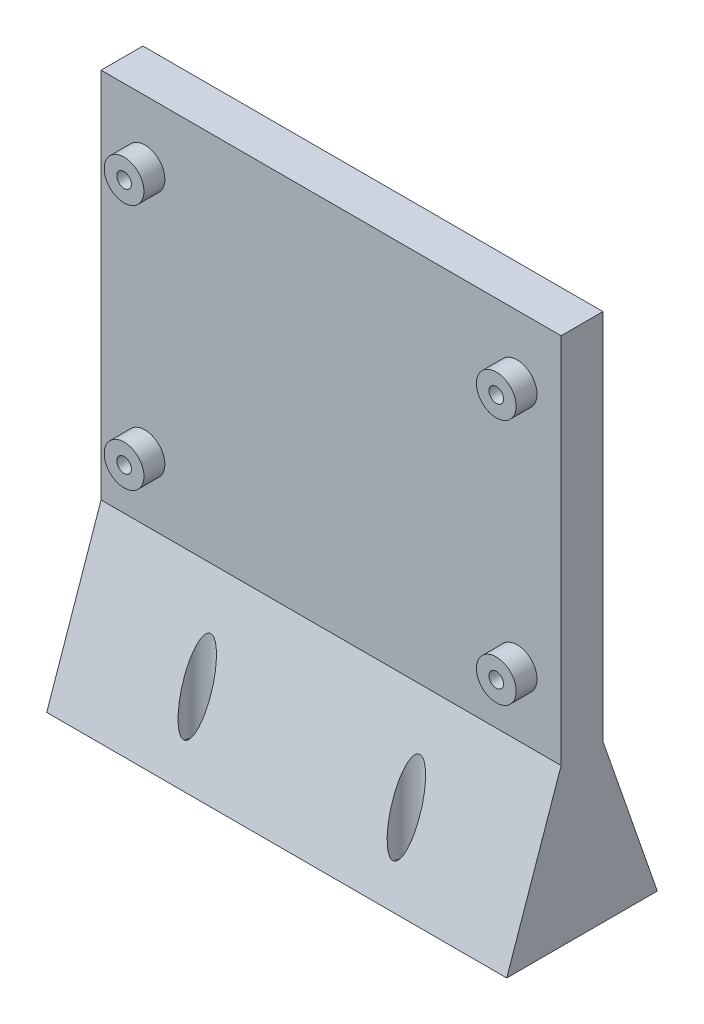
ISO-10303-21;
HEADER;
FILE_DESCRIPTION(('STEP AP214'),'2;1');
FILE_NAME('part.step','',(''),(''),'','','');
FILE_SCHEMA(('AUTOMOTIVE_DESIGN { 1 0 10303 214 1 1 1 1 }'));
ENDSEC;
DATA;
#1=APPLICATION_CONTEXT('core data for automotive mechanical design processes');
#2=APPLICATION_PROTOCOL_DEFINITION('international standard','automotive_design',2000,#1);
#3=PRODUCT_CONTEXT('',#1,'mechanical');
#4=PRODUCT('Part','Part','',(#3));
#5=PRODUCT_RELATED_PRODUCT_CATEGORY('part','',(#4));
#6=PRODUCT_DEFINITION_FORMATION('','',#4);
#7=PRODUCT_DEFINITION_CONTEXT('part definition',#1,'design');
#8=PRODUCT_DEFINITION('design','',#6,#7);
#9=PRODUCT_DEFINITION_SHAPE('','',#8);
#10=(LENGTH_UNIT() NAMED_UNIT(*) SI_UNIT(.MILLI.,.METRE.));
#11=(NAMED_UNIT(*) PLANE_ANGLE_UNIT() SI_UNIT($,.RADIAN.));
#12=(NAMED_UNIT(*) SI_UNIT($,.STERADIAN.) SOLID_ANGLE_UNIT());
#13=UNCERTAINTY_MEASURE_WITH_UNIT(LENGTH_MEASURE(1.E-05),#10,'distance_accuracy_value','');
#14=(GEOMETRIC_REPRESENTATION_CONTEXT(3) GLOBAL_UNCERTAINTY_ASSIGNED_CONTEXT((#13)) GLOBAL_UNIT_ASSIGNED_CONTEXT((#10,
#11,#12)) REPRESENTATION_CONTEXT('',''));
#15=CARTESIAN_POINT('',(0.,0.,0.));
#16=DIRECTION('',(0.,0.,1.));
#17=DIRECTION('',(1.,0.,0.));
#18=AXIS2_PLACEMENT_3D('',#15,#16,#17);
#19=CARTESIAN_POINT('',(55.,0.,10.));
#20=DIRECTION('',(1.,0.,0.));
#21=DIRECTION('',(0.,1.,0.));
#22=AXIS2_PLACEMENT_3D('',#19,#20,#21);
#23=PLANE('',#22);
#24=DIRECTION('',(0.,-1.,0.));
#25=VECTOR('',#24,1.);
#26=CARTESIAN_POINT('',(55.,0.,0.));
#27=LINE('',#26,#25);
#28=CARTESIAN_POINT('',(55.,44.5,0.));
#29=VERTEX_POINT('',#28);
#30=CARTESIAN_POINT('',(55.,-44.5,0.));
#31=VERTEX_POINT('',#30);
#32=EDGE_CURVE('E268',#29,#31,#27,.T.);
#33=ORIENTED_EDGE('',*,*,#32,.F.);
#34=DIRECTION('',(0.,0.,-1.));
#35=VECTOR('',#34,1.);
#36=CARTESIAN_POINT('',(55.,44.5,10.));
#37=LINE('',#36,#35);
#38=CARTESIAN_POINT('',(55.,44.5,10.));
#39=VERTEX_POINT('',#38);
#40=EDGE_CURVE('E13',#39,#29,#37,.T.);
#41=ORIENTED_EDGE('',*,*,#40,.F.);
#42=DIRECTION('',(0.,-1.,0.));
#43=VECTOR('',#42,1.);
#44=CARTESIAN_POINT('',(55.,0.,10.));
#45=LINE('',#44,#43);
#46=CARTESIAN_POINT('',(55.,-44.5,10.));
#47=VERTEX_POINT('',#46);
#48=EDGE_CURVE('E286',#39,#47,#45,.T.);
#49=ORIENTED_EDGE('',*,*,#48,.T.);
#50=DIRECTION('',(0.,-0.944836198498626,0.327543215479524));
#51=VECTOR('',#50,1.);
#52=CARTESIAN_POINT('',(55.,-44.5,10.));
#53=LINE('',#52,#51);
#54=CARTESIAN_POINT('',(55.,-82.,23.));
#55=VERTEX_POINT('',#54);
#56=EDGE_CURVE('E140',#47,#55,#53,.T.);
#57=ORIENTED_EDGE('',*,*,#56,.T.);
#58=DIRECTION('',(0.,0.,-1.));
#59=VECTOR('',#58,1.);
#60=CARTESIAN_POINT('',(55.,-82.,23.));
#61=LINE('',#60,#59);
#62=CARTESIAN_POINT('',(55.,-82.,-13.));
#63=VERTEX_POINT('',#62);
#64=EDGE_CURVE('E132',#55,#63,#61,.T.);
#65=ORIENTED_EDGE('',*,*,#64,.T.);
#66=DIRECTION('',(0.,-0.944836198498626,-0.327543215479523));
#67=VECTOR('',#66,1.);
#68=CARTESIAN_POINT('',(55.,-44.5,0.));
#69=LINE('',#68,#67);
#70=EDGE_CURVE('E131',#31,#63,#69,.T.);
#71=ORIENTED_EDGE('',*,*,#70,.F.);
#72=EDGE_LOOP('',(#33,#41,#49,#57,#65,#71));
#73=FACE_BOUND('',#72,.T.);
#74=ADVANCED_FACE('F51',(#73),#23,.T.);
#75=CARTESIAN_POINT('',(0.,44.5,10.));
#76=DIRECTION('',(0.,1.,0.));
#77=DIRECTION('',(0.,0.,1.));
#78=AXIS2_PLACEMENT_3D('',#75,#76,#77);
#79=PLANE('',#78);
#80=DIRECTION('',(1.,0.,0.));
#81=VECTOR('',#80,1.);
#82=CARTESIAN_POINT('',(0.,44.5,0.));
#83=LINE('',#82,#81);
#84=CARTESIAN_POINT('',(-55.,44.5,0.));
#85=VERTEX_POINT('',#84);
#86=EDGE_CURVE('E271',#85,#29,#83,.T.);
#87=ORIENTED_EDGE('',*,*,#86,.F.);
#88=DIRECTION('',(0.,0.,-1.));
#89=VECTOR('',#88,1.);
#90=CARTESIAN_POINT('',(-55.,44.5,10.));
#91=LINE('',#90,#89);
#92=CARTESIAN_POINT('',(-55.,44.5,10.));
#93=VERTEX_POINT('',#92);
#94=EDGE_CURVE('E60',#93,#85,#91,.T.);
#95=ORIENTED_EDGE('',*,*,#94,.F.);
#96=DIRECTION('',(1.,0.,0.));
#97=VECTOR('',#96,1.);
#98=CARTESIAN_POINT('',(0.,44.5,10.));
#99=LINE('',#98,#97);
#100=EDGE_CURVE('E282',#93,#39,#99,.T.);
#101=ORIENTED_EDGE('',*,*,#100,.T.);
#102=ORIENTED_EDGE('',*,*,#40,.T.);
#103=EDGE_LOOP('',(#87,#95,#101,#102));
#104=FACE_BOUND('',#103,.T.);
#105=ADVANCED_FACE('F260',(#104),#79,.T.);
#106=CARTESIAN_POINT('',(-55.,0.,10.));
#107=DIRECTION('',(1.,0.,0.));
#108=DIRECTION('',(0.,1.,0.));
#109=AXIS2_PLACEMENT_3D('',#106,#107,#108);
#110=PLANE('',#109);
#111=DIRECTION('',(0.,-1.,0.));
#112=VECTOR('',#111,1.);
#113=CARTESIAN_POINT('',(-55.,0.,0.));
#114=LINE('',#113,#112);
#115=CARTESIAN_POINT('',(-55.,-44.5,0.));
#116=VERTEX_POINT('',#115);
#117=EDGE_CURVE('E138',#85,#116,#114,.T.);
#118=ORIENTED_EDGE('',*,*,#117,.T.);
#119=DIRECTION('',(0.,-0.944836198498626,-0.327543215479523));
#120=VECTOR('',#119,1.);
#121=CARTESIAN_POINT('',(-55.,-44.5,0.));
#122=LINE('',#121,#120);
#123=CARTESIAN_POINT('',(-55.,-82.,-13.));
#124=VERTEX_POINT('',#123);
#125=EDGE_CURVE('E129',#116,#124,#122,.T.);
#126=ORIENTED_EDGE('',*,*,#125,.T.);
#127=DIRECTION('',(0.,0.,1.));
#128=VECTOR('',#127,1.);
#129=CARTESIAN_POINT('',(-55.,-82.,23.));
#130=LINE('',#129,#128);
#131=CARTESIAN_POINT('',(-55.,-82.,23.));
#132=VERTEX_POINT('',#131);
#133=EDGE_CURVE('E104',#124,#132,#130,.T.);
#134=ORIENTED_EDGE('',*,*,#133,.T.);
#135=DIRECTION('',(0.,-0.944836198498626,0.327543215479524));
#136=VECTOR('',#135,1.);
#137=CARTESIAN_POINT('',(-55.,-44.5,10.));
#138=LINE('',#137,#136);
#139=CARTESIAN_POINT('',(-55.,-44.5,10.));
#140=VERTEX_POINT('',#139);
#141=EDGE_CURVE('E142',#140,#132,#138,.T.);
#142=ORIENTED_EDGE('',*,*,#141,.F.);
#143=DIRECTION('',(0.,-1.,0.));
#144=VECTOR('',#143,1.);
#145=CARTESIAN_POINT('',(-55.,0.,10.));
#146=LINE('',#145,#144);
#147=EDGE_CURVE('E73',#93,#140,#146,.T.);
#148=ORIENTED_EDGE('',*,*,#147,.F.);
#149=ORIENTED_EDGE('',*,*,#94,.T.);
#150=EDGE_LOOP('',(#118,#126,#134,#142,#148,#149));
#151=FACE_BOUND('',#150,.T.);
#152=ADVANCED_FACE('F136',(#151),#110,.F.);
#153=CARTESIAN_POINT('',(0.,0.,10.));
#154=DIRECTION('',(0.,0.,1.));
#155=DIRECTION('',(1.,0.,0.));
#156=AXIS2_PLACEMENT_3D('',#153,#154,#155);
#157=PLANE('',#156);
#158=CARTESIAN_POINT('',(44.5,29.5,10.));
#159=DIRECTION('',(0.,0.,1.));
#160=DIRECTION('',(1.,0.,0.));
#161=AXIS2_PLACEMENT_3D('',#158,#159,#160);
#162=CIRCLE('',#161,4.75);
#163=CARTESIAN_POINT('',(49.25,29.5,10.));
#164=VERTEX_POINT('',#163);
#165=EDGE_CURVE('E353',#164,#164,#162,.T.);
#166=ORIENTED_EDGE('',*,*,#165,.F.);
#167=EDGE_LOOP('',(#166));
#168=FACE_BOUND('',#167,.T.);
#169=CARTESIAN_POINT('',(44.5,-29.5,10.));
#170=DIRECTION('',(0.,0.,1.));
#171=DIRECTION('',(1.,0.,0.));
#172=AXIS2_PLACEMENT_3D('',#169,#170,#171);
#173=CIRCLE('',#172,4.75);
#174=CARTESIAN_POINT('',(49.25,-29.5,10.));
#175=VERTEX_POINT('',#174);
#176=EDGE_CURVE('E392',#175,#175,#173,.T.);
#177=ORIENTED_EDGE('',*,*,#176,.F.);
#178=EDGE_LOOP('',(#177));
#179=FACE_BOUND('',#178,.T.);
#180=CARTESIAN_POINT('',(-44.5,-29.5,10.));
#181=DIRECTION('',(0.,0.,1.));
#182=DIRECTION('',(1.,0.,0.));
#183=AXIS2_PLACEMENT_3D('',#180,#181,#182);
#184=CIRCLE('',#183,4.75);
#185=CARTESIAN_POINT('',(-39.75,-29.5,10.));
#186=VERTEX_POINT('',#185);
#187=EDGE_CURVE('E395',#186,#186,#184,.T.);
#188=ORIENTED_EDGE('',*,*,#187,.F.);
#189=EDGE_LOOP('',(#188));
#190=FACE_BOUND('',#189,.T.);
#191=CARTESIAN_POINT('',(-44.5,29.5,10.));
#192=DIRECTION('',(0.,0.,1.));
#193=DIRECTION('',(1.,0.,0.));
#194=AXIS2_PLACEMENT_3D('',#191,#192,#193);
#195=CIRCLE('',#194,4.75);
#196=CARTESIAN_POINT('',(-39.75,29.5,10.));
#197=VERTEX_POINT('',#196);
#198=EDGE_CURVE('E287',#197,#197,#195,.T.);
#199=ORIENTED_EDGE('',*,*,#198,.F.);
#200=EDGE_LOOP('',(#199));
#201=FACE_BOUND('',#200,.T.);
#202=ORIENTED_EDGE('',*,*,#48,.F.);
#203=ORIENTED_EDGE('',*,*,#100,.F.);
#204=ORIENTED_EDGE('',*,*,#147,.T.);
#205=DIRECTION('',(1.,0.,0.));
#206=VECTOR('',#205,1.);
#207=CARTESIAN_POINT('',(0.,-44.5,10.));
#208=LINE('',#207,#206);
#209=EDGE_CURVE('E68',#140,#47,#208,.T.);
#210=ORIENTED_EDGE('',*,*,#209,.T.);
#211=EDGE_LOOP('',(#202,#203,#204,#210));
#212=FACE_BOUND('',#211,.T.);
#213=ADVANCED_FACE('F300',(#168,#179,#190,#201,#212),#157,.T.);
#214=CARTESIAN_POINT('',(0.,0.,0.));
#215=DIRECTION('',(0.,0.,1.));
#216=DIRECTION('',(1.,0.,0.));
#217=AXIS2_PLACEMENT_3D('',#214,#215,#216);
#218=PLANE('',#217);
#219=ORIENTED_EDGE('',*,*,#32,.T.);
#220=DIRECTION('',(1.,0.,0.));
#221=VECTOR('',#220,1.);
#222=CARTESIAN_POINT('',(0.,-44.5,0.));
#223=LINE('',#222,#221);
#224=EDGE_CURVE('E278',#116,#31,#223,.T.);
#225=ORIENTED_EDGE('',*,*,#224,.F.);
#226=ORIENTED_EDGE('',*,*,#117,.F.);
#227=ORIENTED_EDGE('',*,*,#86,.T.);
#228=EDGE_LOOP('',(#219,#225,#226,#227));
#229=FACE_BOUND('',#228,.T.);
#230=CARTESIAN_POINT('',(-44.5,29.5,0.));
#231=DIRECTION('',(0.,0.,1.));
#232=DIRECTION('',(1.,0.,0.));
#233=AXIS2_PLACEMENT_3D('',#230,#231,#232);
#234=CIRCLE('',#233,1.75);
#235=CARTESIAN_POINT('',(-42.75,29.5,0.));
#236=VERTEX_POINT('',#235);
#237=EDGE_CURVE('E362',#236,#236,#234,.T.);
#238=ORIENTED_EDGE('',*,*,#237,.T.);
#239=EDGE_LOOP('',(#238));
#240=FACE_BOUND('',#239,.T.);
#241=CARTESIAN_POINT('',(44.5,29.5,0.));
#242=DIRECTION('',(0.,0.,1.));
#243=DIRECTION('',(1.,0.,0.));
#244=AXIS2_PLACEMENT_3D('',#241,#242,#243);
#245=CIRCLE('',#244,1.75);
#246=CARTESIAN_POINT('',(46.25,29.5,0.));
#247=VERTEX_POINT('',#246);
#248=EDGE_CURVE('E359',#247,#247,#245,.T.);
#249=ORIENTED_EDGE('',*,*,#248,.T.);
#250=EDGE_LOOP('',(#249));
#251=FACE_BOUND('',#250,.T.);
#252=CARTESIAN_POINT('',(44.5,-29.5,0.));
#253=DIRECTION('',(0.,0.,1.));
#254=DIRECTION('',(1.,0.,0.));
#255=AXIS2_PLACEMENT_3D('',#252,#253,#254);
#256=CIRCLE('',#255,1.75);
#257=CARTESIAN_POINT('',(46.25,-29.5,0.));
#258=VERTEX_POINT('',#257);
#259=EDGE_CURVE('E371',#258,#258,#256,.T.);
#260=ORIENTED_EDGE('',*,*,#259,.T.);
#261=EDGE_LOOP('',(#260));
#262=FACE_BOUND('',#261,.T.);
#263=CARTESIAN_POINT('',(-44.5,-29.5,0.));
#264=DIRECTION('',(0.,0.,1.));
#265=DIRECTION('',(1.,0.,0.));
#266=AXIS2_PLACEMENT_3D('',#263,#264,#265);
#267=CIRCLE('',#266,1.75);
#268=CARTESIAN_POINT('',(-42.75,-29.5,0.));
#269=VERTEX_POINT('',#268);
#270=EDGE_CURVE('E380',#269,#269,#267,.T.);
#271=ORIENTED_EDGE('',*,*,#270,.T.);
#272=EDGE_LOOP('',(#271));
#273=FACE_BOUND('',#272,.T.);
#274=ADVANCED_FACE('F275',(#229,#240,#251,#262,#273),#218,.F.);
#275=CARTESIAN_POINT('',(-44.5,29.5,33.4350288425444));
#276=DIRECTION('',(0.,0.,-1.));
#277=DIRECTION('',(-1.,0.,0.));
#278=AXIS2_PLACEMENT_3D('',#275,#276,#277);
#279=CYLINDRICAL_SURFACE('',#278,1.75);
#280=ORIENTED_EDGE('',*,*,#237,.F.);
#281=EDGE_LOOP('',(#280));
#282=FACE_BOUND('',#281,.T.);
#283=CARTESIAN_POINT('',(-44.5,29.5,15.));
#284=DIRECTION('',(0.,0.,1.));
#285=DIRECTION('',(1.,0.,0.));
#286=AXIS2_PLACEMENT_3D('',#283,#284,#285);
#287=CIRCLE('',#286,1.75);
#288=CARTESIAN_POINT('',(-42.75,29.5,15.));
#289=VERTEX_POINT('',#288);
#290=EDGE_CURVE('E358',#289,#289,#287,.T.);
#291=ORIENTED_EDGE('',*,*,#290,.T.);
#292=EDGE_LOOP('',(#291));
#293=FACE_BOUND('',#292,.T.);
#294=ADVANCED_FACE('F303',(#282,#293),#279,.F.);
#295=CARTESIAN_POINT('',(-44.5,29.5,33.4350288425444));
#296=DIRECTION('',(0.,0.,-1.));
#297=DIRECTION('',(-1.,0.,0.));
#298=AXIS2_PLACEMENT_3D('',#295,#296,#297);
#299=CYLINDRICAL_SURFACE('',#298,4.75);
#300=ORIENTED_EDGE('',*,*,#198,.T.);
#301=EDGE_LOOP('',(#300));
#302=FACE_BOUND('',#301,.T.);
#303=CARTESIAN_POINT('',(-44.5,29.5,15.));
#304=DIRECTION('',(0.,0.,1.));
#305=DIRECTION('',(1.,0.,0.));
#306=AXIS2_PLACEMENT_3D('',#303,#304,#305);
#307=CIRCLE('',#306,4.75);
#308=CARTESIAN_POINT('',(-39.75,29.5,15.));
#309=VERTEX_POINT('',#308);
#310=EDGE_CURVE('E272',#309,#309,#307,.T.);
#311=ORIENTED_EDGE('',*,*,#310,.F.);
#312=EDGE_LOOP('',(#311));
#313=FACE_BOUND('',#312,.T.);
#314=ADVANCED_FACE('F310',(#302,#313),#299,.T.);
#315=CARTESIAN_POINT('',(0.,0.,15.));
#316=DIRECTION('',(0.,0.,1.));
#317=DIRECTION('',(1.,0.,0.));
#318=AXIS2_PLACEMENT_3D('',#315,#316,#317);
#319=PLANE('',#318);
#320=ORIENTED_EDGE('',*,*,#290,.F.);
#321=EDGE_LOOP('',(#320));
#322=FACE_BOUND('',#321,.T.);
#323=ORIENTED_EDGE('',*,*,#310,.T.);
#324=EDGE_LOOP('',(#323));
#325=FACE_BOUND('',#324,.T.);
#326=ADVANCED_FACE('F307',(#322,#325),#319,.T.);
#327=CARTESIAN_POINT('',(44.5,29.5,33.4350288425444));
#328=DIRECTION('',(0.,0.,-1.));
#329=DIRECTION('',(-1.,0.,0.));
#330=AXIS2_PLACEMENT_3D('',#327,#328,#329);
#331=CYLINDRICAL_SURFACE('',#330,1.75);
#332=ORIENTED_EDGE('',*,*,#248,.F.);
#333=EDGE_LOOP('',(#332));
#334=FACE_BOUND('',#333,.T.);
#335=CARTESIAN_POINT('',(44.5,29.5,15.));
#336=DIRECTION('',(0.,0.,1.));
#337=DIRECTION('',(1.,0.,0.));
#338=AXIS2_PLACEMENT_3D('',#335,#336,#337);
#339=CIRCLE('',#338,1.75);
#340=CARTESIAN_POINT('',(46.25,29.5,15.));
#341=VERTEX_POINT('',#340);
#342=EDGE_CURVE('E365',#341,#341,#339,.T.);
#343=ORIENTED_EDGE('',*,*,#342,.T.);
#344=EDGE_LOOP('',(#343));
#345=FACE_BOUND('',#344,.T.);
#346=ADVANCED_FACE('F180',(#334,#345),#331,.F.);
#347=CARTESIAN_POINT('',(44.5,29.5,33.4350288425444));
#348=DIRECTION('',(0.,0.,-1.));
#349=DIRECTION('',(-1.,0.,0.));
#350=AXIS2_PLACEMENT_3D('',#347,#348,#349);
#351=CYLINDRICAL_SURFACE('',#350,4.75);
#352=ORIENTED_EDGE('',*,*,#165,.T.);
#353=EDGE_LOOP('',(#352));
#354=FACE_BOUND('',#353,.T.);
#355=CARTESIAN_POINT('',(44.5,29.5,15.));
#356=DIRECTION('',(0.,0.,1.));
#357=DIRECTION('',(1.,0.,0.));
#358=AXIS2_PLACEMENT_3D('',#355,#356,#357);
#359=CIRCLE('',#358,4.75);
#360=CARTESIAN_POINT('',(49.25,29.5,15.));
#361=VERTEX_POINT('',#360);
#362=EDGE_CURVE('E356',#361,#361,#359,.T.);
#363=ORIENTED_EDGE('',*,*,#362,.F.);
#364=EDGE_LOOP('',(#363));
#365=FACE_BOUND('',#364,.T.);
#366=ADVANCED_FACE('F342',(#354,#365),#351,.T.);
#367=CARTESIAN_POINT('',(0.,0.,15.));
#368=DIRECTION('',(0.,0.,1.));
#369=DIRECTION('',(1.,0.,0.));
#370=AXIS2_PLACEMENT_3D('',#367,#368,#369);
#371=PLANE('',#370);
#372=ORIENTED_EDGE('',*,*,#342,.F.);
#373=EDGE_LOOP('',(#372));
#374=FACE_BOUND('',#373,.T.);
#375=ORIENTED_EDGE('',*,*,#362,.T.);
#376=EDGE_LOOP('',(#375));
#377=FACE_BOUND('',#376,.T.);
#378=ADVANCED_FACE('F339',(#374,#377),#371,.T.);
#379=CARTESIAN_POINT('',(44.5,-29.5,33.4350288425444));
#380=DIRECTION('',(0.,0.,-1.));
#381=DIRECTION('',(-1.,0.,0.));
#382=AXIS2_PLACEMENT_3D('',#379,#380,#381);
#383=CYLINDRICAL_SURFACE('',#382,1.75);
#384=ORIENTED_EDGE('',*,*,#259,.F.);
#385=EDGE_LOOP('',(#384));
#386=FACE_BOUND('',#385,.T.);
#387=CARTESIAN_POINT('',(44.5,-29.5,15.));
#388=DIRECTION('',(0.,0.,1.));
#389=DIRECTION('',(1.,0.,0.));
#390=AXIS2_PLACEMENT_3D('',#387,#388,#389);
#391=CIRCLE('',#390,1.75);
#392=CARTESIAN_POINT('',(46.25,-29.5,15.));
#393=VERTEX_POINT('',#392);
#394=EDGE_CURVE('E374',#393,#393,#391,.T.);
#395=ORIENTED_EDGE('',*,*,#394,.T.);
#396=EDGE_LOOP('',(#395));
#397=FACE_BOUND('',#396,.T.);
#398=ADVANCED_FACE('F335',(#386,#397),#383,.F.);
#399=CARTESIAN_POINT('',(44.5,-29.5,33.4350288425444));
#400=DIRECTION('',(0.,0.,-1.));
#401=DIRECTION('',(-1.,0.,0.));
#402=AXIS2_PLACEMENT_3D('',#399,#400,#401);
#403=CYLINDRICAL_SURFACE('',#402,4.75);
#404=ORIENTED_EDGE('',*,*,#176,.T.);
#405=EDGE_LOOP('',(#404));
#406=FACE_BOUND('',#405,.T.);
#407=CARTESIAN_POINT('',(44.5,-29.5,15.));
#408=DIRECTION('',(0.,0.,1.));
#409=DIRECTION('',(1.,0.,0.));
#410=AXIS2_PLACEMENT_3D('',#407,#408,#409);
#411=CIRCLE('',#410,4.75);
#412=CARTESIAN_POINT('',(49.25,-29.5,15.));
#413=VERTEX_POINT('',#412);
#414=EDGE_CURVE('E370',#413,#413,#411,.T.);
#415=ORIENTED_EDGE('',*,*,#414,.F.);
#416=EDGE_LOOP('',(#415));
#417=FACE_BOUND('',#416,.T.);
#418=ADVANCED_FACE('F331',(#406,#417),#403,.T.);
#419=CARTESIAN_POINT('',(0.,0.,15.));
#420=DIRECTION('',(0.,0.,1.));
#421=DIRECTION('',(1.,0.,0.));
#422=AXIS2_PLACEMENT_3D('',#419,#420,#421);
#423=PLANE('',#422);
#424=ORIENTED_EDGE('',*,*,#394,.F.);
#425=EDGE_LOOP('',(#424));
#426=FACE_BOUND('',#425,.T.);
#427=ORIENTED_EDGE('',*,*,#414,.T.);
#428=EDGE_LOOP('',(#427));
#429=FACE_BOUND('',#428,.T.);
#430=ADVANCED_FACE('F327',(#426,#429),#423,.T.);
#431=CARTESIAN_POINT('',(-44.5,-29.5,33.4350288425444));
#432=DIRECTION('',(0.,0.,-1.));
#433=DIRECTION('',(-1.,0.,0.));
#434=AXIS2_PLACEMENT_3D('',#431,#432,#433);
#435=CYLINDRICAL_SURFACE('',#434,1.75);
#436=ORIENTED_EDGE('',*,*,#270,.F.);
#437=EDGE_LOOP('',(#436));
#438=FACE_BOUND('',#437,.T.);
#439=CARTESIAN_POINT('',(-44.5,-29.5,15.));
#440=DIRECTION('',(0.,0.,1.));
#441=DIRECTION('',(1.,0.,0.));
#442=AXIS2_PLACEMENT_3D('',#439,#440,#441);
#443=CIRCLE('',#442,1.75);
#444=CARTESIAN_POINT('',(-42.75,-29.5,15.));
#445=VERTEX_POINT('',#444);
#446=EDGE_CURVE('E205',#445,#445,#443,.T.);
#447=ORIENTED_EDGE('',*,*,#446,.T.);
#448=EDGE_LOOP('',(#447));
#449=FACE_BOUND('',#448,.T.);
#450=ADVANCED_FACE('F323',(#438,#449),#435,.F.);
#451=CARTESIAN_POINT('',(-44.5,-29.5,33.4350288425444));
#452=DIRECTION('',(0.,0.,-1.));
#453=DIRECTION('',(-1.,0.,0.));
#454=AXIS2_PLACEMENT_3D('',#451,#452,#453);
#455=CYLINDRICAL_SURFACE('',#454,4.75);
#456=ORIENTED_EDGE('',*,*,#187,.T.);
#457=EDGE_LOOP('',(#456));
#458=FACE_BOUND('',#457,.T.);
#459=CARTESIAN_POINT('',(-44.5,-29.5,15.));
#460=DIRECTION('',(0.,0.,1.));
#461=DIRECTION('',(1.,0.,0.));
#462=AXIS2_PLACEMENT_3D('',#459,#460,#461);
#463=CIRCLE('',#462,4.75);
#464=CARTESIAN_POINT('',(-39.75,-29.5,15.));
#465=VERTEX_POINT('',#464);
#466=EDGE_CURVE('E379',#465,#465,#463,.T.);
#467=ORIENTED_EDGE('',*,*,#466,.F.);
#468=EDGE_LOOP('',(#467));
#469=FACE_BOUND('',#468,.T.);
#470=ADVANCED_FACE('F319',(#458,#469),#455,.T.);
#471=CARTESIAN_POINT('',(0.,0.,15.));
#472=DIRECTION('',(0.,0.,1.));
#473=DIRECTION('',(1.,0.,0.));
#474=AXIS2_PLACEMENT_3D('',#471,#472,#473);
#475=PLANE('',#474);
#476=ORIENTED_EDGE('',*,*,#446,.F.);
#477=EDGE_LOOP('',(#476));
#478=FACE_BOUND('',#477,.T.);
#479=ORIENTED_EDGE('',*,*,#466,.T.);
#480=EDGE_LOOP('',(#479));
#481=FACE_BOUND('',#480,.T.);
#482=ADVANCED_FACE('F178',(#478,#481),#475,.T.);
#483=CARTESIAN_POINT('',(0.,-82.,0.));
#484=DIRECTION('',(0.,-1.,0.));
#485=DIRECTION('',(0.,0.,-1.));
#486=AXIS2_PLACEMENT_3D('',#483,#484,#485);
#487=PLANE('',#486);
#488=CARTESIAN_POINT('',(-25.,-82.,-6.99999999999998));
#489=DIRECTION('',(0.,-1.,0.));
#490=DIRECTION('',(0.,0.,-1.));
#491=AXIS2_PLACEMENT_3D('',#488,#489,#490);
#492=CIRCLE('',#491,1.69999999999999);
#493=CARTESIAN_POINT('',(-25.,-82.,-8.69999999999997));
#494=VERTEX_POINT('',#493);
#495=EDGE_CURVE('E55',#494,#494,#492,.T.);
#496=ORIENTED_EDGE('',*,*,#495,.F.);
#497=EDGE_LOOP('',(#496));
#498=FACE_BOUND('',#497,.T.);
#499=CARTESIAN_POINT('',(25.,-82.,-6.99999999999998));
#500=DIRECTION('',(0.,-1.,0.));
#501=DIRECTION('',(0.,0.,-1.));
#502=AXIS2_PLACEMENT_3D('',#499,#500,#501);
#503=CIRCLE('',#502,1.69999999999999);
#504=CARTESIAN_POINT('',(25.,-82.,-8.69999999999997));
#505=VERTEX_POINT('',#504);
#506=EDGE_CURVE('E234',#505,#505,#503,.T.);
#507=ORIENTED_EDGE('',*,*,#506,.F.);
#508=EDGE_LOOP('',(#507));
#509=FACE_BOUND('',#508,.T.);
#510=CARTESIAN_POINT('',(25.,-82.,17.));
#511=DIRECTION('',(0.,-1.,0.));
#512=DIRECTION('',(0.,0.,-1.));
#513=AXIS2_PLACEMENT_3D('',#510,#511,#512);
#514=CIRCLE('',#513,1.69999999999999);
#515=CARTESIAN_POINT('',(25.,-82.,15.3));
#516=VERTEX_POINT('',#515);
#517=EDGE_CURVE('E222',#516,#516,#514,.T.);
#518=ORIENTED_EDGE('',*,*,#517,.F.);
#519=EDGE_LOOP('',(#518));
#520=FACE_BOUND('',#519,.T.);
#521=CARTESIAN_POINT('',(-25.,-82.,17.));
#522=DIRECTION('',(0.,-1.,0.));
#523=DIRECTION('',(0.,0.,-1.));
#524=AXIS2_PLACEMENT_3D('',#521,#522,#523);
#525=CIRCLE('',#524,1.69999999999999);
#526=CARTESIAN_POINT('',(-25.,-82.,15.3));
#527=VERTEX_POINT('',#526);
#528=EDGE_CURVE('E218',#527,#527,#525,.T.);
#529=ORIENTED_EDGE('',*,*,#528,.F.);
#530=EDGE_LOOP('',(#529));
#531=FACE_BOUND('',#530,.T.);
#532=ORIENTED_EDGE('',*,*,#64,.F.);
#533=DIRECTION('',(1.,0.,0.));
#534=VECTOR('',#533,1.);
#535=CARTESIAN_POINT('',(-55.,-82.,23.));
#536=LINE('',#535,#534);
#537=EDGE_CURVE('E113',#132,#55,#536,.T.);
#538=ORIENTED_EDGE('',*,*,#537,.F.);
#539=ORIENTED_EDGE('',*,*,#133,.F.);
#540=DIRECTION('',(-1.,0.,0.));
#541=VECTOR('',#540,1.);
#542=CARTESIAN_POINT('',(-55.,-82.,-13.));
#543=LINE('',#542,#541);
#544=EDGE_CURVE('E109',#63,#124,#543,.T.);
#545=ORIENTED_EDGE('',*,*,#544,.F.);
#546=EDGE_LOOP('',(#532,#538,#539,#545));
#547=FACE_BOUND('',#546,.T.);
#548=ADVANCED_FACE('F108',(#498,#509,#520,#531,#547),#487,.T.);
#549=CARTESIAN_POINT('',(0.,-4.77416283129661,13.7716235518172));
#550=DIRECTION('',(0.,0.327543215479523,-0.944836198498626));
#551=DIRECTION('',(0.,0.944836198498626,0.327543215479523));
#552=AXIS2_PLACEMENT_3D('',#549,#550,#551);
#553=PLANE('',#552);
#554=CARTESIAN_POINT('',(-25.,-64.6923076923077,-6.99999999999998));
#555=DIRECTION('',(0.,0.327543215479523,-0.944836198498626));
#556=DIRECTION('',(0.,0.944836198498626,0.327543215479523));
#557=AXIS2_PLACEMENT_3D('',#554,#555,#556);
#558=ELLIPSE('',#557,9.92235481123306,3.24999999999999);
#559=CARTESIAN_POINT('',(-25.,-55.3173076923077,-3.74999999999999));
#560=VERTEX_POINT('',#559);
#561=EDGE_CURVE('E241',#560,#560,#558,.T.);
#562=ORIENTED_EDGE('',*,*,#561,.F.);
#563=EDGE_LOOP('',(#562));
#564=FACE_BOUND('',#563,.T.);
#565=CARTESIAN_POINT('',(25.,-64.6923076923077,-6.99999999999998));
#566=DIRECTION('',(0.,0.327543215479523,-0.944836198498626));
#567=DIRECTION('',(0.,0.944836198498626,0.327543215479523));
#568=AXIS2_PLACEMENT_3D('',#565,#566,#567);
#569=ELLIPSE('',#568,9.92235481123306,3.24999999999999);
#570=CARTESIAN_POINT('',(25.,-55.3173076923077,-3.74999999999999));
#571=VERTEX_POINT('',#570);
#572=EDGE_CURVE('E230',#571,#571,#569,.T.);
#573=ORIENTED_EDGE('',*,*,#572,.F.);
#574=EDGE_LOOP('',(#573));
#575=FACE_BOUND('',#574,.T.);
#576=ORIENTED_EDGE('',*,*,#70,.T.);
#577=ORIENTED_EDGE('',*,*,#544,.T.);
#578=ORIENTED_EDGE('',*,*,#125,.F.);
#579=ORIENTED_EDGE('',*,*,#224,.T.);
#580=EDGE_LOOP('',(#576,#577,#578,#579));
#581=FACE_BOUND('',#580,.T.);
#582=ADVANCED_FACE('F127',(#564,#575,#581),#553,.T.);
#583=CARTESIAN_POINT('',(0.,-1.67941596571973,-4.84446913188384));
#584=DIRECTION('',(0.,0.327543215479524,0.944836198498626));
#585=DIRECTION('',(0.,-0.944836198498626,0.327543215479524));
#586=AXIS2_PLACEMENT_3D('',#583,#584,#585);
#587=PLANE('',#586);
#588=CARTESIAN_POINT('',(25.,-64.6923076923077,17.));
#589=DIRECTION('',(0.,0.327543215479524,0.944836198498626));
#590=DIRECTION('',(0.,0.944836198498626,-0.327543215479524));
#591=AXIS2_PLACEMENT_3D('',#588,#589,#590);
#592=ELLIPSE('',#591,9.92235481123304,3.24999999999999);
#593=CARTESIAN_POINT('',(25.,-55.3173076923078,13.75));
#594=VERTEX_POINT('',#593);
#595=EDGE_CURVE('E226',#594,#594,#592,.T.);
#596=ORIENTED_EDGE('',*,*,#595,.F.);
#597=EDGE_LOOP('',(#596));
#598=FACE_BOUND('',#597,.T.);
#599=CARTESIAN_POINT('',(-25.,-64.6923076923077,17.));
#600=DIRECTION('',(0.,0.327543215479524,0.944836198498626));
#601=DIRECTION('',(0.,0.944836198498626,-0.327543215479524));
#602=AXIS2_PLACEMENT_3D('',#599,#600,#601);
#603=ELLIPSE('',#602,9.92235481123304,3.24999999999999);
#604=CARTESIAN_POINT('',(-25.,-55.3173076923078,13.75));
#605=VERTEX_POINT('',#604);
#606=EDGE_CURVE('E144',#605,#605,#603,.T.);
#607=ORIENTED_EDGE('',*,*,#606,.F.);
#608=EDGE_LOOP('',(#607));
#609=FACE_BOUND('',#608,.T.);
#610=ORIENTED_EDGE('',*,*,#141,.T.);
#611=ORIENTED_EDGE('',*,*,#537,.T.);
#612=ORIENTED_EDGE('',*,*,#56,.F.);
#613=ORIENTED_EDGE('',*,*,#209,.F.);
#614=EDGE_LOOP('',(#610,#611,#612,#613));
#615=FACE_BOUND('',#614,.T.);
#616=ADVANCED_FACE('F161',(#598,#609,#615),#587,.T.);
#617=CARTESIAN_POINT('',(-25.,-44.5,17.));
#618=DIRECTION('',(0.,1.,0.));
#619=DIRECTION('',(0.,0.,1.));
#620=AXIS2_PLACEMENT_3D('',#617,#618,#619);
#621=CYLINDRICAL_SURFACE('',#620,1.69999999999999);
#622=ORIENTED_EDGE('',*,*,#528,.T.);
#623=EDGE_LOOP('',(#622));
#624=FACE_BOUND('',#623,.T.);
#625=CARTESIAN_POINT('',(-25.,-77.5,17.));
#626=DIRECTION('',(0.,1.,0.));
#627=DIRECTION('',(0.,0.,1.));
#628=AXIS2_PLACEMENT_3D('',#625,#626,#627);
#629=CIRCLE('',#628,1.69999999999999);
#630=CARTESIAN_POINT('',(-25.,-77.5,18.7));
#631=VERTEX_POINT('',#630);
#632=EDGE_CURVE('E215',#631,#631,#629,.T.);
#633=ORIENTED_EDGE('',*,*,#632,.T.);
#634=EDGE_LOOP('',(#633));
#635=FACE_BOUND('',#634,.T.);
#636=ADVANCED_FACE('F171',(#624,#635),#621,.F.);
#637=CARTESIAN_POINT('',(-23.3,-77.5,17.));
#638=DIRECTION('',(0.,-1.,0.));
#639=DIRECTION('',(0.,0.,-1.));
#640=AXIS2_PLACEMENT_3D('',#637,#638,#639);
#641=PLANE('',#640);
#642=ORIENTED_EDGE('',*,*,#632,.F.);
#643=EDGE_LOOP('',(#642));
#644=FACE_BOUND('',#643,.T.);
#645=CARTESIAN_POINT('',(-25.,-77.5,17.));
#646=DIRECTION('',(0.,1.,0.));
#647=DIRECTION('',(0.,0.,1.));
#648=AXIS2_PLACEMENT_3D('',#645,#646,#647);
#649=CIRCLE('',#648,3.24999999999999);
#650=CARTESIAN_POINT('',(-25.,-77.5,20.25));
#651=VERTEX_POINT('',#650);
#652=EDGE_CURVE('E219',#651,#651,#649,.T.);
#653=ORIENTED_EDGE('',*,*,#652,.T.);
#654=EDGE_LOOP('',(#653));
#655=FACE_BOUND('',#654,.T.);
#656=ADVANCED_FACE('F430',(#644,#655),#641,.F.);
#657=CARTESIAN_POINT('',(-25.,-44.5,17.));
#658=DIRECTION('',(0.,1.,0.));
#659=DIRECTION('',(0.,0.,1.));
#660=AXIS2_PLACEMENT_3D('',#657,#658,#659);
#661=CYLINDRICAL_SURFACE('',#660,3.24999999999999);
#662=ORIENTED_EDGE('',*,*,#606,.T.);
#663=EDGE_LOOP('',(#662));
#664=FACE_BOUND('',#663,.T.);
#665=ORIENTED_EDGE('',*,*,#652,.F.);
#666=EDGE_LOOP('',(#665));
#667=FACE_BOUND('',#666,.T.);
#668=ADVANCED_FACE('F435',(#664,#667),#661,.F.);
#669=CARTESIAN_POINT('',(25.,-44.5,17.));
#670=DIRECTION('',(0.,1.,0.));
#671=DIRECTION('',(0.,0.,1.));
#672=AXIS2_PLACEMENT_3D('',#669,#670,#671);
#673=CYLINDRICAL_SURFACE('',#672,1.69999999999999);
#674=ORIENTED_EDGE('',*,*,#517,.T.);
#675=EDGE_LOOP('',(#674));
#676=FACE_BOUND('',#675,.T.);
#677=CARTESIAN_POINT('',(25.,-77.5,17.));
#678=DIRECTION('',(0.,1.,0.));
#679=DIRECTION('',(0.,0.,1.));
#680=AXIS2_PLACEMENT_3D('',#677,#678,#679);
#681=CIRCLE('',#680,1.69999999999999);
#682=CARTESIAN_POINT('',(25.,-77.5,18.7));
#683=VERTEX_POINT('',#682);
#684=EDGE_CURVE('E223',#683,#683,#681,.T.);
#685=ORIENTED_EDGE('',*,*,#684,.T.);
#686=EDGE_LOOP('',(#685));
#687=FACE_BOUND('',#686,.T.);
#688=ADVANCED_FACE('F440',(#676,#687),#673,.F.);
#689=CARTESIAN_POINT('',(26.7,-77.5,17.));
#690=DIRECTION('',(0.,-1.,0.));
#691=DIRECTION('',(0.,0.,-1.));
#692=AXIS2_PLACEMENT_3D('',#689,#690,#691);
#693=PLANE('',#692);
#694=ORIENTED_EDGE('',*,*,#684,.F.);
#695=EDGE_LOOP('',(#694));
#696=FACE_BOUND('',#695,.T.);
#697=CARTESIAN_POINT('',(25.,-77.5,17.));
#698=DIRECTION('',(0.,1.,0.));
#699=DIRECTION('',(0.,0.,1.));
#700=AXIS2_PLACEMENT_3D('',#697,#698,#699);
#701=CIRCLE('',#700,3.24999999999999);
#702=CARTESIAN_POINT('',(25.,-77.5,20.25));
#703=VERTEX_POINT('',#702);
#704=EDGE_CURVE('E227',#703,#703,#701,.T.);
#705=ORIENTED_EDGE('',*,*,#704,.T.);
#706=EDGE_LOOP('',(#705));
#707=FACE_BOUND('',#706,.T.);
#708=ADVANCED_FACE('F446',(#696,#707),#693,.F.);
#709=CARTESIAN_POINT('',(25.,-44.5,17.));
#710=DIRECTION('',(0.,1.,0.));
#711=DIRECTION('',(0.,0.,1.));
#712=AXIS2_PLACEMENT_3D('',#709,#710,#711);
#713=CYLINDRICAL_SURFACE('',#712,3.24999999999999);
#714=ORIENTED_EDGE('',*,*,#595,.T.);
#715=EDGE_LOOP('',(#714));
#716=FACE_BOUND('',#715,.T.);
#717=ORIENTED_EDGE('',*,*,#704,.F.);
#718=EDGE_LOOP('',(#717));
#719=FACE_BOUND('',#718,.T.);
#720=ADVANCED_FACE('F452',(#716,#719),#713,.F.);
#721=CARTESIAN_POINT('',(25.,-44.5,-6.99999999999998));
#722=DIRECTION('',(0.,1.,0.));
#723=DIRECTION('',(0.,0.,1.));
#724=AXIS2_PLACEMENT_3D('',#721,#722,#723);
#725=CYLINDRICAL_SURFACE('',#724,1.69999999999999);
#726=ORIENTED_EDGE('',*,*,#506,.T.);
#727=EDGE_LOOP('',(#726));
#728=FACE_BOUND('',#727,.T.);
#729=CARTESIAN_POINT('',(25.,-77.5,-6.99999999999998));
#730=DIRECTION('',(0.,1.,0.));
#731=DIRECTION('',(0.,0.,1.));
#732=AXIS2_PLACEMENT_3D('',#729,#730,#731);
#733=CIRCLE('',#732,1.69999999999999);
#734=CARTESIAN_POINT('',(25.,-77.5,-5.29999999999999));
#735=VERTEX_POINT('',#734);
#736=EDGE_CURVE('E231',#735,#735,#733,.T.);
#737=ORIENTED_EDGE('',*,*,#736,.T.);
#738=EDGE_LOOP('',(#737));
#739=FACE_BOUND('',#738,.T.);
#740=ADVANCED_FACE('F456',(#728,#739),#725,.F.);
#741=CARTESIAN_POINT('',(26.7,-77.5,-6.99999999999998));
#742=DIRECTION('',(0.,-1.,0.));
#743=DIRECTION('',(0.,0.,-1.));
#744=AXIS2_PLACEMENT_3D('',#741,#742,#743);
#745=PLANE('',#744);
#746=ORIENTED_EDGE('',*,*,#736,.F.);
#747=EDGE_LOOP('',(#746));
#748=FACE_BOUND('',#747,.T.);
#749=CARTESIAN_POINT('',(25.,-77.5,-6.99999999999998));
#750=DIRECTION('',(0.,1.,0.));
#751=DIRECTION('',(0.,0.,1.));
#752=AXIS2_PLACEMENT_3D('',#749,#750,#751);
#753=CIRCLE('',#752,3.24999999999999);
#754=CARTESIAN_POINT('',(25.,-77.5,-3.74999999999999));
#755=VERTEX_POINT('',#754);
#756=EDGE_CURVE('E235',#755,#755,#753,.T.);
#757=ORIENTED_EDGE('',*,*,#756,.T.);
#758=EDGE_LOOP('',(#757));
#759=FACE_BOUND('',#758,.T.);
#760=ADVANCED_FACE('F460',(#748,#759),#745,.F.);
#761=CARTESIAN_POINT('',(25.,-44.5,-6.99999999999998));
#762=DIRECTION('',(0.,1.,0.));
#763=DIRECTION('',(0.,0.,1.));
#764=AXIS2_PLACEMENT_3D('',#761,#762,#763);
#765=CYLINDRICAL_SURFACE('',#764,3.24999999999999);
#766=ORIENTED_EDGE('',*,*,#572,.T.);
#767=EDGE_LOOP('',(#766));
#768=FACE_BOUND('',#767,.T.);
#769=ORIENTED_EDGE('',*,*,#756,.F.);
#770=EDGE_LOOP('',(#769));
#771=FACE_BOUND('',#770,.T.);
#772=ADVANCED_FACE('F464',(#768,#771),#765,.F.);
#773=CARTESIAN_POINT('',(-25.,-44.5,-6.99999999999998));
#774=DIRECTION('',(0.,1.,0.));
#775=DIRECTION('',(0.,0.,1.));
#776=AXIS2_PLACEMENT_3D('',#773,#774,#775);
#777=CYLINDRICAL_SURFACE('',#776,1.69999999999999);
#778=ORIENTED_EDGE('',*,*,#495,.T.);
#779=EDGE_LOOP('',(#778));
#780=FACE_BOUND('',#779,.T.);
#781=CARTESIAN_POINT('',(-25.,-77.5,-6.99999999999998));
#782=DIRECTION('',(0.,1.,0.));
#783=DIRECTION('',(0.,0.,1.));
#784=AXIS2_PLACEMENT_3D('',#781,#782,#783);
#785=CIRCLE('',#784,1.69999999999999);
#786=CARTESIAN_POINT('',(-25.,-77.5,-5.29999999999999));
#787=VERTEX_POINT('',#786);
#788=EDGE_CURVE('E238',#787,#787,#785,.T.);
#789=ORIENTED_EDGE('',*,*,#788,.T.);
#790=EDGE_LOOP('',(#789));
#791=FACE_BOUND('',#790,.T.);
#792=ADVANCED_FACE('F255',(#780,#791),#777,.F.);
#793=CARTESIAN_POINT('',(-23.3,-77.5,-6.99999999999998));
#794=DIRECTION('',(0.,-1.,0.));
#795=DIRECTION('',(0.,0.,-1.));
#796=AXIS2_PLACEMENT_3D('',#793,#794,#795);
#797=PLANE('',#796);
#798=ORIENTED_EDGE('',*,*,#788,.F.);
#799=EDGE_LOOP('',(#798));
#800=FACE_BOUND('',#799,.T.);
#801=CARTESIAN_POINT('',(-25.,-77.5,-6.99999999999998));
#802=DIRECTION('',(0.,1.,0.));
#803=DIRECTION('',(0.,0.,1.));
#804=AXIS2_PLACEMENT_3D('',#801,#802,#803);
#805=CIRCLE('',#804,3.24999999999999);
#806=CARTESIAN_POINT('',(-25.,-77.5,-3.74999999999999));
#807=VERTEX_POINT('',#806);
#808=EDGE_CURVE('E242',#807,#807,#805,.T.);
#809=ORIENTED_EDGE('',*,*,#808,.T.);
#810=EDGE_LOOP('',(#809));
#811=FACE_BOUND('',#810,.T.);
#812=ADVANCED_FACE('F246',(#800,#811),#797,.F.);
#813=CARTESIAN_POINT('',(-25.,-44.5,-6.99999999999998));
#814=DIRECTION('',(0.,1.,0.));
#815=DIRECTION('',(0.,0.,1.));
#816=AXIS2_PLACEMENT_3D('',#813,#814,#815);
#817=CYLINDRICAL_SURFACE('',#816,3.24999999999999);
#818=ORIENTED_EDGE('',*,*,#561,.T.);
#819=EDGE_LOOP('',(#818));
#820=FACE_BOUND('',#819,.T.);
#821=ORIENTED_EDGE('',*,*,#808,.F.);
#822=EDGE_LOOP('',(#821));
#823=FACE_BOUND('',#822,.T.);
#824=ADVANCED_FACE('F248',(#820,#823),#817,.F.);
#825=CLOSED_SHELL('',(#74,#105,#152,#213,#274,#294,#314,#326,#346,#366,#378,#398,#418,#430,#450,
#470,#482,#548,#582,#616,#636,#656,#668,#688,#708,#720,#740,#760,#772,#792,#812,#824));
#826=MANIFOLD_SOLID_BREP('B2',#825);
#827=ADVANCED_BREP_SHAPE_REPRESENTATION('',(#18,#826),#14);
#828=SHAPE_DEFINITION_REPRESENTATION(#9,#827);
ENDSEC;
END-ISO-10303-21;
